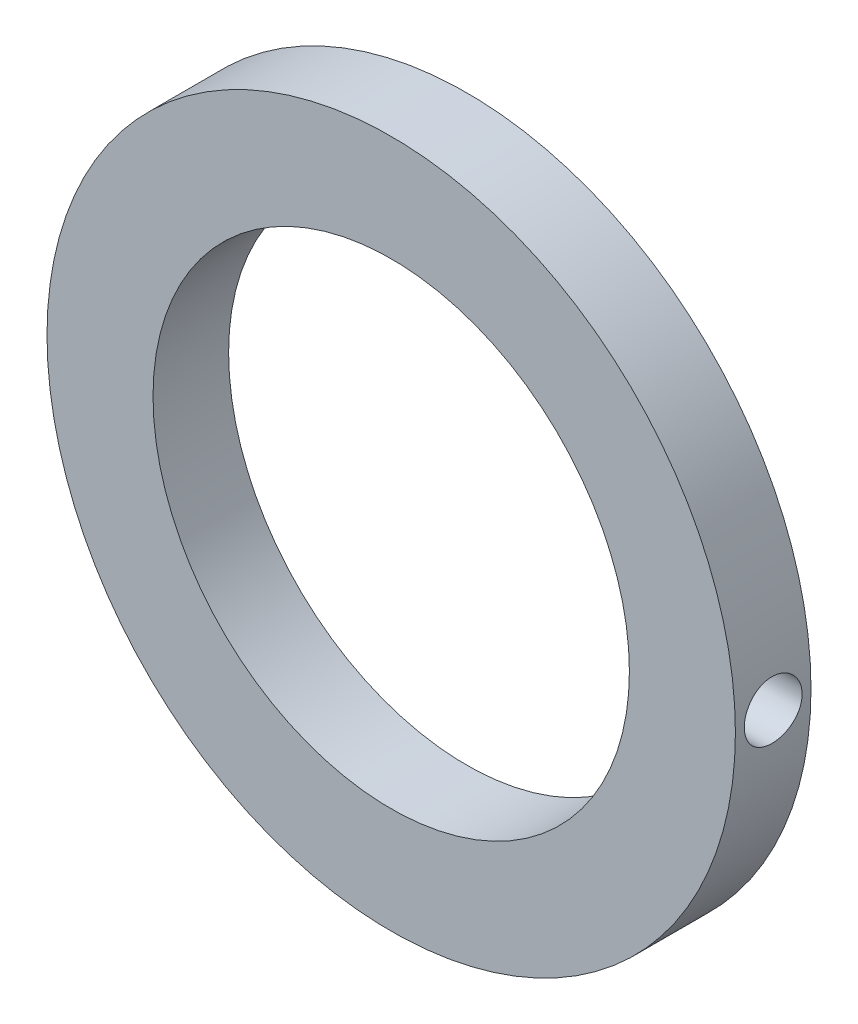
ISO-10303-21;
HEADER;
FILE_DESCRIPTION(('STEP AP214'),'2;1');
FILE_NAME('part.step','',(''),(''),'','','');
FILE_SCHEMA(('AUTOMOTIVE_DESIGN { 1 0 10303 214 1 1 1 1 }'));
ENDSEC;
DATA;
#1=APPLICATION_CONTEXT('core data for automotive mechanical design processes');
#2=APPLICATION_PROTOCOL_DEFINITION('international standard','automotive_design',2000,#1);
#3=PRODUCT_CONTEXT('',#1,'mechanical');
#4=PRODUCT('Part','Part','',(#3));
#5=PRODUCT_RELATED_PRODUCT_CATEGORY('part','',(#4));
#6=PRODUCT_DEFINITION_FORMATION('','',#4);
#7=PRODUCT_DEFINITION_CONTEXT('part definition',#1,'design');
#8=PRODUCT_DEFINITION('design','',#6,#7);
#9=PRODUCT_DEFINITION_SHAPE('','',#8);
#10=(LENGTH_UNIT() NAMED_UNIT(*) SI_UNIT(.MILLI.,.METRE.));
#11=(NAMED_UNIT(*) PLANE_ANGLE_UNIT() SI_UNIT($,.RADIAN.));
#12=(NAMED_UNIT(*) SI_UNIT($,.STERADIAN.) SOLID_ANGLE_UNIT());
#13=UNCERTAINTY_MEASURE_WITH_UNIT(LENGTH_MEASURE(1.E-05),#10,'distance_accuracy_value','');
#14=(GEOMETRIC_REPRESENTATION_CONTEXT(3) GLOBAL_UNCERTAINTY_ASSIGNED_CONTEXT((#13)) GLOBAL_UNIT_ASSIGNED_CONTEXT((#10,
#11,#12)) REPRESENTATION_CONTEXT('',''));
#15=CARTESIAN_POINT('',(0.,0.,0.));
#16=DIRECTION('',(0.,0.,1.));
#17=DIRECTION('',(1.,0.,0.));
#18=AXIS2_PLACEMENT_3D('',#15,#16,#17);
#19=CARTESIAN_POINT('',(0.,0.,5.49));
#20=DIRECTION('',(0.,0.,1.));
#21=DIRECTION('',(1.,0.,0.));
#22=AXIS2_PLACEMENT_3D('',#19,#20,#21);
#23=PLANE('',#22);
#24=CARTESIAN_POINT('',(0.,0.,5.49));
#25=DIRECTION('',(0.,0.,1.));
#26=DIRECTION('',(1.,0.,0.));
#27=AXIS2_PLACEMENT_3D('',#24,#25,#26);
#28=CIRCLE('',#27,25.);
#29=CARTESIAN_POINT('',(25.,0.,5.49));
#30=VERTEX_POINT('',#29);
#31=EDGE_CURVE('E44',#30,#30,#28,.T.);
#32=ORIENTED_EDGE('',*,*,#31,.T.);
#33=EDGE_LOOP('',(#32));
#34=FACE_BOUND('',#33,.T.);
#35=CARTESIAN_POINT('',(0.,0.,5.49));
#36=DIRECTION('',(0.,0.,1.));
#37=DIRECTION('',(1.,0.,0.));
#38=AXIS2_PLACEMENT_3D('',#35,#36,#37);
#39=CIRCLE('',#38,17.3);
#40=CARTESIAN_POINT('',(17.3,0.,5.49));
#41=VERTEX_POINT('',#40);
#42=EDGE_CURVE('E53',#41,#41,#39,.T.);
#43=ORIENTED_EDGE('',*,*,#42,.F.);
#44=EDGE_LOOP('',(#43));
#45=FACE_BOUND('',#44,.T.);
#46=ADVANCED_FACE('F33',(#34,#45),#23,.T.);
#47=CARTESIAN_POINT('',(0.,0.,0.));
#48=DIRECTION('',(0.,0.,1.));
#49=DIRECTION('',(1.,0.,0.));
#50=AXIS2_PLACEMENT_3D('',#47,#48,#49);
#51=PLANE('',#50);
#52=CARTESIAN_POINT('',(0.,0.,0.));
#53=DIRECTION('',(0.,0.,1.));
#54=DIRECTION('',(1.,0.,0.));
#55=AXIS2_PLACEMENT_3D('',#52,#53,#54);
#56=CIRCLE('',#55,25.);
#57=CARTESIAN_POINT('',(25.,0.,0.));
#58=VERTEX_POINT('',#57);
#59=EDGE_CURVE('E48',#58,#58,#56,.T.);
#60=ORIENTED_EDGE('',*,*,#59,.F.);
#61=EDGE_LOOP('',(#60));
#62=FACE_BOUND('',#61,.T.);
#63=CARTESIAN_POINT('',(0.,0.,0.));
#64=DIRECTION('',(0.,0.,1.));
#65=DIRECTION('',(1.,0.,0.));
#66=AXIS2_PLACEMENT_3D('',#63,#64,#65);
#67=CIRCLE('',#66,17.3);
#68=CARTESIAN_POINT('',(17.3,0.,0.));
#69=VERTEX_POINT('',#68);
#70=EDGE_CURVE('E55',#69,#69,#67,.T.);
#71=ORIENTED_EDGE('',*,*,#70,.T.);
#72=EDGE_LOOP('',(#71));
#73=FACE_BOUND('',#72,.T.);
#74=ADVANCED_FACE('F80',(#62,#73),#51,.F.);
#75=CARTESIAN_POINT('',(0.,0.,5.49));
#76=DIRECTION('',(0.,0.,-1.));
#77=DIRECTION('',(-1.,0.,0.));
#78=AXIS2_PLACEMENT_3D('',#75,#76,#77);
#79=CYLINDRICAL_SURFACE('',#78,25.);
#80=CARTESIAN_POINT('',(25.,0.,4.845));
#81=CARTESIAN_POINT('',(24.9999988451139,0.117735278301276,4.8449948591209));
#82=CARTESIAN_POINT('',(24.999159439058,0.235550621457058,4.83506555466472));
#83=CARTESIAN_POINT('',(24.9958915886789,0.467921355431264,4.79560193119813));
#84=CARTESIAN_POINT('',(24.9934613459453,0.582472903468533,4.76604542346334));
#85=CARTESIAN_POINT('',(24.9872864405936,0.804916984024061,4.68818833742142));
#86=CARTESIAN_POINT('',(24.9835425236502,0.912813253479284,4.63989839104647));
#87=CARTESIAN_POINT('',(24.9751600854516,1.11894303335121,4.52596428191015));
#88=CARTESIAN_POINT('',(24.9705217551206,1.21717859922322,4.4603238217314));
#89=CARTESIAN_POINT('',(24.9608575183451,1.40147830131933,4.31336862830681));
#90=CARTESIAN_POINT('',(24.955830747152,1.48751399732498,4.23201828127083));
#91=CARTESIAN_POINT('',(24.9459634292896,1.64472769019545,4.05602782467784));
#92=CARTESIAN_POINT('',(24.9411228908244,1.7159050331262,3.9613871305031));
#93=CARTESIAN_POINT('',(24.9321668151734,1.84147798748344,3.76133006468495));
#94=CARTESIAN_POINT('',(24.9280523629138,1.89584857566637,3.65589793357945));
#95=CARTESIAN_POINT('',(24.921024238874,1.98610479418016,3.43736063395057));
#96=CARTESIAN_POINT('',(24.9181105455772,2.02199075574169,3.32425560296094));
#97=CARTESIAN_POINT('',(24.9138211232251,2.07417649243372,3.09386828647696));
#98=CARTESIAN_POINT('',(24.9124417539622,2.09052263300635,2.97659657224925));
#99=CARTESIAN_POINT('',(24.911365657586,2.10330795994963,2.74096651264018));
#100=CARTESIAN_POINT('',(24.9116688984332,2.0997475253731,2.62260818799245));
#101=CARTESIAN_POINT('',(24.9139204517025,2.07285908629668,2.38848247593001));
#102=CARTESIAN_POINT('',(24.9158645698409,2.04958148076321,2.27270925441342));
#103=CARTESIAN_POINT('',(24.921172244675,1.98399776957959,2.04671890617991));
#104=CARTESIAN_POINT('',(24.9245358154292,1.9416914754658,1.93650183450414));
#105=CARTESIAN_POINT('',(24.9323082295503,1.83919490807231,1.72459188643426));
#106=CARTESIAN_POINT('',(24.9367183925469,1.77898203223505,1.62290999280599));
#107=CARTESIAN_POINT('',(24.946085858417,1.6423978168818,1.4310768857018));
#108=CARTESIAN_POINT('',(24.9510431725507,1.56602614478757,1.340925909615));
#109=CARTESIAN_POINT('',(24.9609650307947,1.39900961766385,1.17442065533437));
#110=CARTESIAN_POINT('',(24.9659295495825,1.30832119361694,1.09811007159919));
#111=CARTESIAN_POINT('',(24.9752917805496,1.11539744954134,0.961789647241763));
#112=CARTESIAN_POINT('',(24.9796894923422,1.01316212163371,0.901779817742303));
#113=CARTESIAN_POINT('',(24.9874234637268,0.800018187297086,0.799767045767462));
#114=CARTESIAN_POINT('',(24.9907596086261,0.689108645309339,0.757766048813211));
#115=CARTESIAN_POINT('',(24.9959932431944,0.461777679712801,0.692993841103508));
#116=CARTESIAN_POINT('',(24.9978907632006,0.345356372389236,0.670222224844312));
#117=CARTESIAN_POINT('',(25.0000294542468,0.110685374747226,0.644609987791147));
#118=CARTESIAN_POINT('',(25.0002756406783,-0.00755768502697374,0.641709015775344));
#119=CARTESIAN_POINT('',(24.9990973229847,-0.242848466222472,0.655762301028749));
#120=CARTESIAN_POINT('',(24.9976728346974,-0.359896198964754,0.672716370073931));
#121=CARTESIAN_POINT('',(24.9933165886336,-0.589301610021186,0.725948450908578));
#122=CARTESIAN_POINT('',(24.990387013828,-0.701665826801415,0.762198478664155));
#123=CARTESIAN_POINT('',(24.983349678364,-0.918717159670533,0.852964882563737));
#124=CARTESIAN_POINT('',(24.9792418987888,-1.02340415246355,0.907481551990918));
#125=CARTESIAN_POINT('',(24.9702960985375,-1.2224039382341,1.03338530050732));
#126=CARTESIAN_POINT('',(24.965456357735,-1.31669136468878,1.1048123490671));
#127=CARTESIAN_POINT('',(24.9555961208146,-1.49195945781636,1.26245158183302));
#128=CARTESIAN_POINT('',(24.9505756215068,-1.57293988952858,1.34866402704894));
#129=CARTESIAN_POINT('',(24.9409048550227,-1.71950236146227,1.53368873644081));
#130=CARTESIAN_POINT('',(24.9362555545386,-1.78504501053789,1.63253226081215));
#131=CARTESIAN_POINT('',(24.9278673194929,-1.89860128345402,1.83985777173426));
#132=CARTESIAN_POINT('',(24.9241283757168,-1.94661508471776,1.94833966071374));
#133=CARTESIAN_POINT('',(24.9179896347876,-2.0236836700678,2.17172317976008));
#134=CARTESIAN_POINT('',(24.9155881367168,-2.05276254295261,2.28661645040216));
#135=CARTESIAN_POINT('',(24.9123905136638,-2.09121424772467,2.51967574771736));
#136=CARTESIAN_POINT('',(24.9115943573012,-2.10058746480856,2.63784171037172));
#137=CARTESIAN_POINT('',(24.9116980263289,-2.0993573038631,2.8737006197584));
#138=CARTESIAN_POINT('',(24.9125925971993,-2.08881581770842,2.99139389655386));
#139=CARTESIAN_POINT('',(24.9159657588738,-2.04818456610882,3.22333213740431));
#140=CARTESIAN_POINT('',(24.9184443520736,-2.0180947710967,3.33757709624337));
#141=CARTESIAN_POINT('',(24.9247048971289,-1.93923676960908,3.55937957577286));
#142=CARTESIAN_POINT('',(24.9284867693278,-1.89046970467076,3.66693750470139));
#143=CARTESIAN_POINT('',(24.9369278791651,-1.7756483998683,3.87234969907619));
#144=CARTESIAN_POINT('',(24.9415871033584,-1.70959442491631,3.97020411319167));
#145=CARTESIAN_POINT('',(24.9512751633025,-1.56184177296828,4.15374830249334));
#146=CARTESIAN_POINT('',(24.9563050547018,-1.48009725844233,4.2394011227904));
#147=CARTESIAN_POINT('',(24.9661580680237,-1.30336744445176,4.39580542806891));
#148=CARTESIAN_POINT('',(24.9709811396395,-1.20837894715087,4.46655330377463));
#149=CARTESIAN_POINT('',(24.979885915923,-1.00767168553692,4.59123588055421));
#150=CARTESIAN_POINT('',(24.9839662060955,-0.901933033810631,4.64513864008595));
#151=CARTESIAN_POINT('',(24.9909091416548,-0.682943647154568,4.7343556662617));
#152=CARTESIAN_POINT('',(24.9937731849977,-0.569701710606556,4.76969128516092));
#153=CARTESIAN_POINT('',(24.9972262572294,-0.379827267742648,4.81177862000435));
#154=CARTESIAN_POINT('',(24.9982616713185,-0.304415608983806,4.82422006194308));
#155=CARTESIAN_POINT('',(24.9996489162793,-0.152680524020631,4.84083240781016));
#156=CARTESIAN_POINT('',(25.0000007490002,-0.0763571002833914,4.84500333411214));
#157=CARTESIAN_POINT('',(25.,0.,4.845));
#158=B_SPLINE_CURVE_WITH_KNOTS('',3,(#80,#81,#82,#83,#84,#85,#86,#87,#88,#89,#90,#91,#92,#93,
#94,#95,#96,#97,#98,#99,#100,#101,#102,#103,#104,#105,#106,#107,#108,#109,#110,#111,#112,#113,
#114,#115,#116,#117,#118,#119,#120,#121,#122,#123,#124,#125,#126,#127,#128,#129,#130,#131,#132,
#133,#134,#135,#136,#137,#138,#139,#140,#141,#142,#143,#144,#145,#146,#147,#148,#149,#150,#151,
#152,#153,#154,#155,#156,#157),.UNSPECIFIED.,.T.,.F.,(4,2,2,2,2,2,2,2,2,2,2,2,2,2,2,2,2,2,2,2,2,
2,2,2,2,2,2,2,2,2,2,2,2,2,2,2,2,2,4),(0.,0.352927046496938,0.706253760891374,1.05938024173724,
1.4124314264912,1.76629256661713,2.12016927731719,2.4745703581015,2.8289650880625,
3.1825172056825,3.53606259113143,3.88870699850852,4.24135489861776,4.59444983114923,
4.94755203174142,5.30175028419993,5.65594877834427,6.01018552744687,6.36441480631847,
6.71756773929081,7.07071732443183,7.42335614292493,7.77600062354198,8.12948708788756,
8.48297979304839,8.83736493102256,9.19174648188695,9.54567630719706,9.89959921399326,
10.2524239912755,10.6052493022132,10.95805305224,11.3108513960647,11.664696519822,
12.0186272299693,12.3732250440697,12.7274141724008,12.9563052845041,13.185195777404),.UNSPECIFIED.);
#159=CARTESIAN_POINT('',(25.,0.,4.845));
#160=VERTEX_POINT('',#159);
#161=EDGE_CURVE('E10',#160,#160,#158,.T.);
#162=ORIENTED_EDGE('',*,*,#161,.T.);
#163=EDGE_LOOP('',(#162));
#164=FACE_BOUND('',#163,.T.);
#165=ORIENTED_EDGE('',*,*,#31,.F.);
#166=EDGE_LOOP('',(#165));
#167=FACE_BOUND('',#166,.T.);
#168=ORIENTED_EDGE('',*,*,#59,.T.);
#169=EDGE_LOOP('',(#168));
#170=FACE_BOUND('',#169,.T.);
#171=ADVANCED_FACE('F35',(#164,#167,#170),#79,.T.);
#172=CARTESIAN_POINT('',(0.,0.,5.49));
#173=DIRECTION('',(0.,0.,-1.));
#174=DIRECTION('',(-1.,0.,0.));
#175=AXIS2_PLACEMENT_3D('',#172,#173,#174);
#176=CYLINDRICAL_SURFACE('',#175,17.3);
#177=CARTESIAN_POINT('',(17.3,0.,4.845));
#178=CARTESIAN_POINT('',(17.2999983998994,0.117494356044248,4.84499499180752));
#179=CARTESIAN_POINT('',(17.2987903877494,0.235062807457324,4.83510610084831));
#180=CARTESIAN_POINT('',(17.2940875793985,0.466930090538228,4.79581239823394));
#181=CARTESIAN_POINT('',(17.2905903746606,0.581225346020822,4.76638703112422));
#182=CARTESIAN_POINT('',(17.2817032856218,0.803155768023466,4.68889844959446));
#183=CARTESIAN_POINT('',(17.2763146549535,0.910795290503495,4.64084757791815));
#184=CARTESIAN_POINT('',(17.2642445463616,1.11646149032329,4.52749851020004));
#185=CARTESIAN_POINT('',(17.2575632958151,1.21448985374212,4.46220334676286));
#186=CARTESIAN_POINT('',(17.2436154103013,1.39868220431815,4.31585566792273));
#187=CARTESIAN_POINT('',(17.2363462008922,1.48478897893607,4.23473138331502));
#188=CARTESIAN_POINT('',(17.2220625226246,1.64220130855825,4.05918226407042));
#189=CARTESIAN_POINT('',(17.2150480665656,1.71350612070833,3.96475676229504));
#190=CARTESIAN_POINT('',(17.2020426430255,1.83950207294477,3.76491573807337));
#191=CARTESIAN_POINT('',(17.1960549879323,1.89413987203864,3.65946635102844));
#192=CARTESIAN_POINT('',(17.185814806759,1.98491019700073,3.44080398713735));
#193=CARTESIAN_POINT('',(17.1815622185469,2.02104338552172,3.32759128846115));
#194=CARTESIAN_POINT('',(17.175298087711,2.0736055421622,3.09720842342499));
#195=CARTESIAN_POINT('',(17.1732755873216,2.09013088622168,2.98006054846969));
#196=CARTESIAN_POINT('',(17.1716670313796,2.10330643272047,2.74463809272484));
#197=CARTESIAN_POINT('',(17.1720808832389,2.09995739044117,2.62636355492213));
#198=CARTESIAN_POINT('',(17.1752882454446,2.07355839345952,2.39271565325665));
#199=CARTESIAN_POINT('',(17.1780689502242,2.05061445230703,2.27733011059553));
#200=CARTESIAN_POINT('',(17.1856767275852,1.98584228744936,2.05205927937777));
#201=CARTESIAN_POINT('',(17.1905038394648,1.94401370109284,1.94217409649231));
#202=CARTESIAN_POINT('',(17.2016750946228,1.84254517402775,1.73069300212232));
#203=CARTESIAN_POINT('',(17.2080231660299,1.78285901223315,1.62911948345038));
#204=CARTESIAN_POINT('',(17.2215179962439,1.64740269281002,1.43739034016706));
#205=CARTESIAN_POINT('',(17.2286647895035,1.57163184124446,1.34723520844382));
#206=CARTESIAN_POINT('',(17.2430087520525,1.40556874373219,1.18028656347057));
#207=CARTESIAN_POINT('',(17.2502059461448,1.31518509128248,1.10358394471425));
#208=CARTESIAN_POINT('',(17.2637961383408,1.12277719676394,0.966424844468856));
#209=CARTESIAN_POINT('',(17.2701891347654,1.0207529303908,0.905968396900865));
#210=CARTESIAN_POINT('',(17.2814542649676,0.807890930637046,0.803018295752776));
#211=CARTESIAN_POINT('',(17.2863259312077,0.697050500964649,0.760530162804429));
#212=CARTESIAN_POINT('',(17.2939951877888,0.469736244720221,0.6947940521764));
#213=CARTESIAN_POINT('',(17.2967928696668,0.353262667013679,0.671545225348375));
#214=CARTESIAN_POINT('',(17.2999870600926,0.118774482305939,0.645065087494808));
#215=CARTESIAN_POINT('',(17.3003985919429,0.000774215465213179,0.641708530919258));
#216=CARTESIAN_POINT('',(17.2988146323803,-0.234107148968165,0.65477793718876));
#217=CARTESIAN_POINT('',(17.2968191892442,-0.350988268960214,0.671203503262702));
#218=CARTESIAN_POINT('',(17.2906548858525,-0.579945228601415,0.72326686687976));
#219=CARTESIAN_POINT('',(17.2864927635,-0.692034806162086,0.758845115361085));
#220=CARTESIAN_POINT('',(17.2764612221224,-0.90865622938904,0.848142109900654));
#221=CARTESIAN_POINT('',(17.2705917481513,-1.01318783168877,0.901861439785568));
#222=CARTESIAN_POINT('',(17.2577627511203,-1.21228648722833,1.0262199224002));
#223=CARTESIAN_POINT('',(17.2507980529049,-1.30680247203427,1.0969402930396));
#224=CARTESIAN_POINT('',(17.2365743572192,-1.4826677740143,1.25317822090358));
#225=CARTESIAN_POINT('',(17.2293153487635,-1.56401659914073,1.33869633086246));
#226=CARTESIAN_POINT('',(17.215274993407,-1.71168126342506,1.52265308368613));
#227=CARTESIAN_POINT('',(17.2084964146528,-1.77791420777794,1.62115850927661));
#228=CARTESIAN_POINT('',(17.196229444087,-1.89289477661774,1.82796878520939));
#229=CARTESIAN_POINT('',(17.1907410276639,-1.94164273466179,1.93627344856449));
#230=CARTESIAN_POINT('',(17.1816944417829,-2.02013462574599,2.15933771165942));
#231=CARTESIAN_POINT('',(17.1781314872777,-2.04992570238107,2.27408052019779));
#232=CARTESIAN_POINT('',(17.1733253499463,-2.0898101815084,2.50698590621785));
#233=CARTESIAN_POINT('',(17.1720820658336,-2.09990444404754,2.62514833415574));
#234=CARTESIAN_POINT('',(17.1720588689465,-2.1000935877219,2.86071421291582));
#235=CARTESIAN_POINT('',(17.1732629160063,-2.0903186941887,2.9781175789448));
#236=CARTESIAN_POINT('',(17.1779642760317,-2.05132233612588,3.20959982517878));
#237=CARTESIAN_POINT('',(17.1814615896663,-2.02210086592303,3.32367870441391));
#238=CARTESIAN_POINT('',(17.1903505444494,-1.94508083198248,3.54525906670556));
#239=CARTESIAN_POINT('',(17.1957415843843,-1.89728816365237,3.65276262456871));
#240=CARTESIAN_POINT('',(17.2078115886314,-1.78449524818068,3.85824477481678));
#241=CARTESIAN_POINT('',(17.2144905654378,-1.71949483410648,3.95622327478636));
#242=CARTESIAN_POINT('',(17.2284363567428,-1.57364729090166,4.14054013815814));
#243=CARTESIAN_POINT('',(17.2357066041071,-1.49270306912663,4.22680141852902));
#244=CARTESIAN_POINT('',(17.2499852593216,-1.31746715580114,4.38456740089608));
#245=CARTESIAN_POINT('',(17.2569936048896,-1.22317231458446,4.45606861089732));
#246=CARTESIAN_POINT('',(17.269986420474,-1.02352535119132,4.58250149719952));
#247=CARTESIAN_POINT('',(17.2759671211479,-0.918134716721204,4.63737271479953));
#248=CARTESIAN_POINT('',(17.2861922668547,-0.699622542284266,4.72856091468692));
#249=CARTESIAN_POINT('',(17.2904386087497,-0.586509607115685,4.76489817837868));
#250=CARTESIAN_POINT('',(17.2956860730188,-0.394002026167382,4.8092313129914));
#251=CARTESIAN_POINT('',(17.2972959681836,-0.315824160149462,4.82262544523015));
#252=CARTESIAN_POINT('',(17.2994534676091,-0.158442091245171,4.8405114471794));
#253=CARTESIAN_POINT('',(17.3000010791038,-0.0792378953516163,4.84500337751228));
#254=CARTESIAN_POINT('',(17.3,0.,4.845));
#255=B_SPLINE_CURVE_WITH_KNOTS('',3,(#177,#178,#179,#180,#181,#182,#183,#184,#185,#186,#187,
#188,#189,#190,#191,#192,#193,#194,#195,#196,#197,#198,#199,#200,#201,#202,#203,#204,#205,#206,
#207,#208,#209,#210,#211,#212,#213,#214,#215,#216,#217,#218,#219,#220,#221,#222,#223,#224,#225,
#226,#227,#228,#229,#230,#231,#232,#233,#234,#235,#236,#237,#238,#239,#240,#241,#242,#243,#244,
#245,#246,#247,#248,#249,#250,#251,#252,#253,#254),.UNSPECIFIED.,.T.,.F.,(4,2,2,2,2,2,2,2,2,2,2,
2,2,2,2,2,2,2,2,2,2,2,2,2,2,2,2,2,2,2,2,2,2,2,2,2,2,2,4),(0.,0.352193650673431,
0.704758453112546,1.05709001634657,1.40935965928436,1.76326524862332,2.11718859484553,
2.47223303020438,2.82726475048192,3.18054410280767,3.53381002963141,3.88517671555416,
4.23655014923525,4.58884103490435,4.94114712244571,5.29574889360324,5.65035140514365,
6.00506278666913,6.35975851177503,6.71221861179274,7.06467164261677,7.41603511119395,
7.76740988862926,8.12049784198376,8.47359898694596,8.82859232959019,9.18357889974607,
9.53767917272533,9.89176398383089,10.2435355553563,10.5953072295053,10.9469673252096,
11.2986308324993,11.6525060339186,12.0064648608034,12.3616954889133,12.7165365554245,
12.9540566765539,13.1915751802092),.UNSPECIFIED.);
#256=CARTESIAN_POINT('',(17.3,0.,4.845));
#257=VERTEX_POINT('',#256);
#258=EDGE_CURVE('E58',#257,#257,#255,.T.);
#259=ORIENTED_EDGE('',*,*,#258,.F.);
#260=EDGE_LOOP('',(#259));
#261=FACE_BOUND('',#260,.T.);
#262=ORIENTED_EDGE('',*,*,#42,.T.);
#263=EDGE_LOOP('',(#262));
#264=FACE_BOUND('',#263,.T.);
#265=ORIENTED_EDGE('',*,*,#70,.F.);
#266=EDGE_LOOP('',(#265));
#267=FACE_BOUND('',#266,.T.);
#268=ADVANCED_FACE('F65',(#261,#264,#267),#176,.F.);
#269=CARTESIAN_POINT('',(0.,0.,2.745));
#270=DIRECTION('',(-1.,0.,0.));
#271=DIRECTION('',(0.,0.,1.));
#272=AXIS2_PLACEMENT_3D('',#269,#270,#271);
#273=CYLINDRICAL_SURFACE('',#272,2.1);
#274=ORIENTED_EDGE('',*,*,#258,.T.);
#275=EDGE_LOOP('',(#274));
#276=FACE_BOUND('',#275,.T.);
#277=ORIENTED_EDGE('',*,*,#161,.F.);
#278=EDGE_LOOP('',(#277));
#279=FACE_BOUND('',#278,.T.);
#280=ADVANCED_FACE('F68',(#276,#279),#273,.F.);
#281=CLOSED_SHELL('',(#46,#74,#171,#268,#280));
#282=MANIFOLD_SOLID_BREP('B2',#281);
#283=ADVANCED_BREP_SHAPE_REPRESENTATION('',(#18,#282),#14);
#284=SHAPE_DEFINITION_REPRESENTATION(#9,#283);
ENDSEC;
END-ISO-10303-21;
